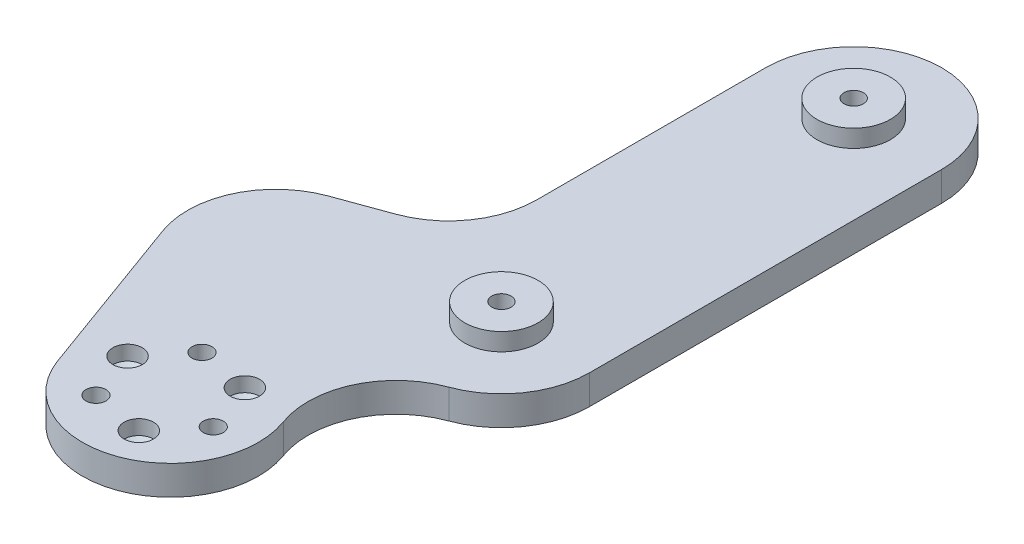
ISO-10303-21;
HEADER;
FILE_DESCRIPTION(('STEP AP214'),'2;1');
FILE_NAME('part.step','',(''),(''),'','','');
FILE_SCHEMA(('AUTOMOTIVE_DESIGN { 1 0 10303 214 1 1 1 1 }'));
ENDSEC;
DATA;
#1=APPLICATION_CONTEXT('core data for automotive mechanical design processes');
#2=APPLICATION_PROTOCOL_DEFINITION('international standard','automotive_design',2000,#1);
#3=PRODUCT_CONTEXT('',#1,'mechanical');
#4=PRODUCT('Part','Part','',(#3));
#5=PRODUCT_RELATED_PRODUCT_CATEGORY('part','',(#4));
#6=PRODUCT_DEFINITION_FORMATION('','',#4);
#7=PRODUCT_DEFINITION_CONTEXT('part definition',#1,'design');
#8=PRODUCT_DEFINITION('design','',#6,#7);
#9=PRODUCT_DEFINITION_SHAPE('','',#8);
#10=(LENGTH_UNIT() NAMED_UNIT(*) SI_UNIT(.MILLI.,.METRE.));
#11=(NAMED_UNIT(*) PLANE_ANGLE_UNIT() SI_UNIT($,.RADIAN.));
#12=(NAMED_UNIT(*) SI_UNIT($,.STERADIAN.) SOLID_ANGLE_UNIT());
#13=UNCERTAINTY_MEASURE_WITH_UNIT(LENGTH_MEASURE(1.E-05),#10,'distance_accuracy_value','');
#14=(GEOMETRIC_REPRESENTATION_CONTEXT(3) GLOBAL_UNCERTAINTY_ASSIGNED_CONTEXT((#13)) GLOBAL_UNIT_ASSIGNED_CONTEXT((#10,
#11,#12)) REPRESENTATION_CONTEXT('',''));
#15=CARTESIAN_POINT('',(0.,0.,0.));
#16=DIRECTION('',(0.,0.,1.));
#17=DIRECTION('',(1.,0.,0.));
#18=AXIS2_PLACEMENT_3D('',#15,#16,#17);
#19=CARTESIAN_POINT('',(-28.1907786235773,5.,10.26060429977));
#20=DIRECTION('',(0.,-1.,0.));
#21=DIRECTION('',(0.,0.,-1.));
#22=AXIS2_PLACEMENT_3D('',#19,#20,#21);
#23=CYLINDRICAL_SURFACE('',#22,15.);
#24=CARTESIAN_POINT('',(-28.1907786235773,0.,10.26060429977));
#25=DIRECTION('',(0.,-1.,0.));
#26=DIRECTION('',(0.,0.,-1.));
#27=AXIS2_PLACEMENT_3D('',#24,#25,#26);
#28=CIRCLE('',#27,15.);
#29=CARTESIAN_POINT('',(-42.2861679353659,0.,15.390906449655));
#30=VERTEX_POINT('',#29);
#31=CARTESIAN_POINT('',(-33.3210807734623,0.,-3.83478501201867));
#32=VERTEX_POINT('',#31);
#33=EDGE_CURVE('E193',#30,#32,#28,.T.);
#34=ORIENTED_EDGE('',*,*,#33,.F.);
#35=DIRECTION('',(0.,-1.,0.));
#36=VECTOR('',#35,1.);
#37=CARTESIAN_POINT('',(-42.2861679353659,5.,15.390906449655));
#38=LINE('',#37,#36);
#39=CARTESIAN_POINT('',(-42.2861679353659,5.,15.390906449655));
#40=VERTEX_POINT('',#39);
#41=EDGE_CURVE('E191',#40,#30,#38,.T.);
#42=ORIENTED_EDGE('',*,*,#41,.F.);
#43=CARTESIAN_POINT('',(-28.1907786235773,5.,10.26060429977));
#44=DIRECTION('',(0.,-1.,0.));
#45=DIRECTION('',(0.,0.,-1.));
#46=AXIS2_PLACEMENT_3D('',#43,#44,#45);
#47=CIRCLE('',#46,15.);
#48=CARTESIAN_POINT('',(-33.3210807734623,5.,-3.83478501201867));
#49=VERTEX_POINT('',#48);
#50=EDGE_CURVE('E198',#40,#49,#47,.T.);
#51=ORIENTED_EDGE('',*,*,#50,.T.);
#52=DIRECTION('',(0.,-1.,0.));
#53=VECTOR('',#52,1.);
#54=CARTESIAN_POINT('',(-33.3210807734623,5.,-3.83478501201867));
#55=LINE('',#54,#53);
#56=EDGE_CURVE('E206',#49,#32,#55,.T.);
#57=ORIENTED_EDGE('',*,*,#56,.T.);
#58=EDGE_LOOP('',(#34,#42,#51,#57));
#59=FACE_BOUND('',#58,.T.);
#60=ADVANCED_FACE('F35',(#59),#23,.T.);
#61=CARTESIAN_POINT('',(0.,8.,0.));
#62=DIRECTION('',(0.,1.,0.));
#63=DIRECTION('',(0.,0.,1.));
#64=AXIS2_PLACEMENT_3D('',#61,#62,#63);
#65=CYLINDRICAL_SURFACE('',#64,1.64999999999999);
#66=CARTESIAN_POINT('',(0.,8.,0.));
#67=DIRECTION('',(0.,1.,0.));
#68=DIRECTION('',(0.,0.,1.));
#69=AXIS2_PLACEMENT_3D('',#66,#67,#68);
#70=CIRCLE('',#69,1.64999999999999);
#71=CARTESIAN_POINT('',(0.,8.,1.64999999999999));
#72=VERTEX_POINT('',#71);
#73=EDGE_CURVE('E209',#72,#72,#70,.T.);
#74=ORIENTED_EDGE('',*,*,#73,.T.);
#75=EDGE_LOOP('',(#74));
#76=FACE_BOUND('',#75,.T.);
#77=CARTESIAN_POINT('',(0.,5.,0.));
#78=DIRECTION('',(0.,-1.,0.));
#79=DIRECTION('',(0.,0.,-1.));
#80=AXIS2_PLACEMENT_3D('',#77,#78,#79);
#81=CIRCLE('',#80,1.64999999999999);
#82=CARTESIAN_POINT('',(0.,5.,-1.64999999999999));
#83=VERTEX_POINT('',#82);
#84=EDGE_CURVE('E257',#83,#83,#81,.F.);
#85=ORIENTED_EDGE('',*,*,#84,.F.);
#86=EDGE_LOOP('',(#85));
#87=FACE_BOUND('',#86,.T.);
#88=ADVANCED_FACE('F332',(#76,#87),#65,.F.);
#89=CARTESIAN_POINT('',(0.,5.,0.));
#90=DIRECTION('',(0.,-1.,0.));
#91=DIRECTION('',(0.,0.,-1.));
#92=AXIS2_PLACEMENT_3D('',#89,#90,#91);
#93=CYLINDRICAL_SURFACE('',#92,15.);
#94=CARTESIAN_POINT('',(0.,5.,0.));
#95=DIRECTION('',(0.,1.,0.));
#96=DIRECTION('',(0.,0.,1.));
#97=AXIS2_PLACEMENT_3D('',#94,#95,#96);
#98=CIRCLE('',#97,15.);
#99=CARTESIAN_POINT('',(5.13030214988499,5.,14.0953893117886));
#100=VERTEX_POINT('',#99);
#101=CARTESIAN_POINT('',(15.,5.,0.));
#102=VERTEX_POINT('',#101);
#103=EDGE_CURVE('E232',#100,#102,#98,.T.);
#104=ORIENTED_EDGE('',*,*,#103,.F.);
#105=DIRECTION('',(0.,-1.,0.));
#106=VECTOR('',#105,1.);
#107=CARTESIAN_POINT('',(5.13030214988499,5.,14.0953893117886));
#108=LINE('',#107,#106);
#109=CARTESIAN_POINT('',(5.13030214988499,0.,14.0953893117886));
#110=VERTEX_POINT('',#109);
#111=EDGE_CURVE('E203',#100,#110,#108,.T.);
#112=ORIENTED_EDGE('',*,*,#111,.T.);
#113=CARTESIAN_POINT('',(0.,0.,0.));
#114=DIRECTION('',(0.,1.,0.));
#115=DIRECTION('',(0.,0.,1.));
#116=AXIS2_PLACEMENT_3D('',#113,#114,#115);
#117=CIRCLE('',#116,15.);
#118=CARTESIAN_POINT('',(15.,0.,0.));
#119=VERTEX_POINT('',#118);
#120=EDGE_CURVE('E229',#110,#119,#117,.T.);
#121=ORIENTED_EDGE('',*,*,#120,.T.);
#122=DIRECTION('',(0.,-1.,0.));
#123=VECTOR('',#122,1.);
#124=CARTESIAN_POINT('',(15.,5.,0.));
#125=LINE('',#124,#123);
#126=EDGE_CURVE('E254',#102,#119,#125,.T.);
#127=ORIENTED_EDGE('',*,*,#126,.F.);
#128=EDGE_LOOP('',(#104,#112,#121,#127));
#129=FACE_BOUND('',#128,.T.);
#130=ADVANCED_FACE('F294',(#129),#93,.T.);
#131=CARTESIAN_POINT('',(15.,5.,0.));
#132=DIRECTION('',(-1.,0.,0.));
#133=DIRECTION('',(0.,0.,1.));
#134=AXIS2_PLACEMENT_3D('',#131,#132,#133);
#135=PLANE('',#134);
#136=DIRECTION('',(0.,0.,-1.));
#137=VECTOR('',#136,1.);
#138=CARTESIAN_POINT('',(15.,0.,0.));
#139=LINE('',#138,#137);
#140=CARTESIAN_POINT('',(15.,0.,-60.));
#141=VERTEX_POINT('',#140);
#142=EDGE_CURVE('E243',#119,#141,#139,.T.);
#143=ORIENTED_EDGE('',*,*,#142,.T.);
#144=DIRECTION('',(0.,-1.,0.));
#145=VECTOR('',#144,1.);
#146=CARTESIAN_POINT('',(15.,5.,-60.));
#147=LINE('',#146,#145);
#148=CARTESIAN_POINT('',(15.,5.,-60.));
#149=VERTEX_POINT('',#148);
#150=EDGE_CURVE('E251',#149,#141,#147,.T.);
#151=ORIENTED_EDGE('',*,*,#150,.F.);
#152=DIRECTION('',(0.,0.,-1.));
#153=VECTOR('',#152,1.);
#154=CARTESIAN_POINT('',(15.,5.,0.));
#155=LINE('',#154,#153);
#156=EDGE_CURVE('E234',#102,#149,#155,.T.);
#157=ORIENTED_EDGE('',*,*,#156,.F.);
#158=ORIENTED_EDGE('',*,*,#126,.T.);
#159=EDGE_LOOP('',(#143,#151,#157,#158));
#160=FACE_BOUND('',#159,.T.);
#161=ADVANCED_FACE('F296',(#160),#135,.F.);
#162=CARTESIAN_POINT('',(0.,5.,-60.));
#163=DIRECTION('',(0.,-1.,0.));
#164=DIRECTION('',(0.,0.,-1.));
#165=AXIS2_PLACEMENT_3D('',#162,#163,#164);
#166=CYLINDRICAL_SURFACE('',#165,15.);
#167=CARTESIAN_POINT('',(0.,0.,-60.));
#168=DIRECTION('',(0.,1.,0.));
#169=DIRECTION('',(0.,0.,1.));
#170=AXIS2_PLACEMENT_3D('',#167,#168,#169);
#171=CIRCLE('',#170,15.);
#172=CARTESIAN_POINT('',(-15.,0.,-60.));
#173=VERTEX_POINT('',#172);
#174=EDGE_CURVE('E245',#141,#173,#171,.T.);
#175=ORIENTED_EDGE('',*,*,#174,.T.);
#176=DIRECTION('',(0.,-1.,0.));
#177=VECTOR('',#176,1.);
#178=CARTESIAN_POINT('',(-15.,5.,-60.));
#179=LINE('',#178,#177);
#180=CARTESIAN_POINT('',(-15.,5.,-60.));
#181=VERTEX_POINT('',#180);
#182=EDGE_CURVE('E241',#181,#173,#179,.T.);
#183=ORIENTED_EDGE('',*,*,#182,.F.);
#184=CARTESIAN_POINT('',(0.,5.,-60.));
#185=DIRECTION('',(0.,1.,0.));
#186=DIRECTION('',(0.,0.,1.));
#187=AXIS2_PLACEMENT_3D('',#184,#185,#186);
#188=CIRCLE('',#187,15.);
#189=EDGE_CURVE('E237',#149,#181,#188,.T.);
#190=ORIENTED_EDGE('',*,*,#189,.F.);
#191=ORIENTED_EDGE('',*,*,#150,.T.);
#192=EDGE_LOOP('',(#175,#183,#190,#191));
#193=FACE_BOUND('',#192,.T.);
#194=ADVANCED_FACE('F302',(#193),#166,.T.);
#195=CARTESIAN_POINT('',(-15.,5.,0.));
#196=DIRECTION('',(1.,0.,0.));
#197=DIRECTION('',(0.,0.,-1.));
#198=AXIS2_PLACEMENT_3D('',#195,#196,#197);
#199=PLANE('',#198);
#200=DIRECTION('',(0.,0.,1.));
#201=VECTOR('',#200,1.);
#202=CARTESIAN_POINT('',(-15.,0.,0.));
#203=LINE('',#202,#201);
#204=CARTESIAN_POINT('',(-15.,0.,-21.0062261462914));
#205=VERTEX_POINT('',#204);
#206=EDGE_CURVE('E235',#173,#205,#203,.T.);
#207=ORIENTED_EDGE('',*,*,#206,.T.);
#208=DIRECTION('',(0.,1.,0.));
#209=VECTOR('',#208,1.);
#210=CARTESIAN_POINT('',(-15.,5.,-21.0062261462914));
#211=LINE('',#210,#209);
#212=CARTESIAN_POINT('',(-15.,5.,-21.0062261462914));
#213=VERTEX_POINT('',#212);
#214=EDGE_CURVE('E260',#205,#213,#211,.T.);
#215=ORIENTED_EDGE('',*,*,#214,.T.);
#216=DIRECTION('',(0.,0.,1.));
#217=VECTOR('',#216,1.);
#218=CARTESIAN_POINT('',(-15.,5.,0.));
#219=LINE('',#218,#217);
#220=EDGE_CURVE('E239',#181,#213,#219,.T.);
#221=ORIENTED_EDGE('',*,*,#220,.F.);
#222=ORIENTED_EDGE('',*,*,#182,.T.);
#223=EDGE_LOOP('',(#207,#215,#221,#222));
#224=FACE_BOUND('',#223,.T.);
#225=ADVANCED_FACE('F306',(#224),#199,.F.);
#226=CARTESIAN_POINT('',(0.,5.,0.));
#227=DIRECTION('',(0.,1.,0.));
#228=DIRECTION('',(0.,0.,1.));
#229=AXIS2_PLACEMENT_3D('',#226,#227,#228);
#230=PLANE('',#229);
#231=CARTESIAN_POINT('',(-26.7934441009171,5.,36.8885493243449));
#232=DIRECTION('',(0.,1.,0.));
#233=DIRECTION('',(0.,0.,1.));
#234=AXIS2_PLACEMENT_3D('',#231,#232,#233);
#235=CIRCLE('',#234,2.49999999999999);
#236=CARTESIAN_POINT('',(-26.7934441009171,5.,39.3885493243449));
#237=VERTEX_POINT('',#236);
#238=EDGE_CURVE('E133',#237,#237,#235,.T.);
#239=ORIENTED_EDGE('',*,*,#238,.F.);
#240=EDGE_LOOP('',(#239));
#241=FACE_BOUND('',#240,.T.);
#242=CARTESIAN_POINT('',(-12.1450858366284,5.,31.5569829352764));
#243=DIRECTION('',(0.,1.,0.));
#244=DIRECTION('',(0.,0.,1.));
#245=AXIS2_PLACEMENT_3D('',#242,#243,#244);
#246=CIRCLE('',#245,2.49999999999999);
#247=CARTESIAN_POINT('',(-12.1450858366284,5.,34.0569829352764));
#248=VERTEX_POINT('',#247);
#249=EDGE_CURVE('E132',#248,#248,#246,.T.);
#250=ORIENTED_EDGE('',*,*,#249,.F.);
#251=EDGE_LOOP('',(#250));
#252=FACE_BOUND('',#251,.T.);
#253=CARTESIAN_POINT('',(-14.8519930338762,5.,46.9086165104204));
#254=DIRECTION('',(0.,1.,0.));
#255=DIRECTION('',(0.,0.,1.));
#256=AXIS2_PLACEMENT_3D('',#253,#254,#255);
#257=CIRCLE('',#256,2.49999999999999);
#258=CARTESIAN_POINT('',(-14.8519930338762,5.,49.4086165104204));
#259=VERTEX_POINT('',#258);
#260=EDGE_CURVE('E143',#259,#259,#257,.T.);
#261=ORIENTED_EDGE('',*,*,#260,.F.);
#262=EDGE_LOOP('',(#261));
#263=FACE_BOUND('',#262,.T.);
#264=CARTESIAN_POINT('',(-23.7152628109861,5.,45.345782911418));
#265=DIRECTION('',(0.,1.,0.));
#266=DIRECTION('',(0.,0.,1.));
#267=AXIS2_PLACEMENT_3D('',#264,#265,#266);
#268=CIRCLE('',#267,1.7);
#269=CARTESIAN_POINT('',(-23.7152628109861,5.,47.045782911418));
#270=VERTEX_POINT('',#269);
#271=EDGE_CURVE('E158',#270,#270,#268,.T.);
#272=ORIENTED_EDGE('',*,*,#271,.F.);
#273=EDGE_LOOP('',(#272));
#274=FACE_BOUND('',#273,.T.);
#275=CARTESIAN_POINT('',(-9.06690454669735,5.,40.0142165223496));
#276=DIRECTION('',(0.,1.,0.));
#277=DIRECTION('',(0.,0.,1.));
#278=AXIS2_PLACEMENT_3D('',#275,#276,#277);
#279=CIRCLE('',#278,1.7);
#280=CARTESIAN_POINT('',(-9.06690454669735,5.,41.7142165223496));
#281=VERTEX_POINT('',#280);
#282=EDGE_CURVE('E168',#281,#281,#279,.T.);
#283=ORIENTED_EDGE('',*,*,#282,.F.);
#284=EDGE_LOOP('',(#283));
#285=FACE_BOUND('',#284,.T.);
#286=CARTESIAN_POINT('',(-21.0083556137382,5.,29.994149336274));
#287=DIRECTION('',(0.,1.,0.));
#288=DIRECTION('',(0.,0.,1.));
#289=AXIS2_PLACEMENT_3D('',#286,#287,#288);
#290=CIRCLE('',#289,1.7);
#291=CARTESIAN_POINT('',(-21.0083556137382,5.,31.694149336274));
#292=VERTEX_POINT('',#291);
#293=EDGE_CURVE('E178',#292,#292,#290,.T.);
#294=ORIENTED_EDGE('',*,*,#293,.F.);
#295=EDGE_LOOP('',(#294));
#296=FACE_BOUND('',#295,.T.);
#297=DIRECTION('',(0.93969262078591,0.,-0.342020143325666));
#298=VECTOR('',#297,1.);
#299=CARTESIAN_POINT('',(-5.13030214988499,5.,-14.0953893117886));
#300=LINE('',#299,#298);
#301=CARTESIAN_POINT('',(-24.869697850115,5.,-6.91083683450272));
#302=VERTEX_POINT('',#301);
#303=EDGE_CURVE('E200',#49,#302,#300,.T.);
#304=ORIENTED_EDGE('',*,*,#303,.F.);
#305=ORIENTED_EDGE('',*,*,#50,.F.);
#306=DIRECTION('',(-0.342020143325669,0.,-0.939692620785908));
#307=VECTOR('',#306,1.);
#308=CARTESIAN_POINT('',(-42.2861679353659,5.,15.390906449655));
#309=LINE('',#308,#307);
#310=CARTESIAN_POINT('',(-32.0255636355958,5.,43.5816850732323));
#311=VERTEX_POINT('',#310);
#312=EDGE_CURVE('E182',#311,#40,#309,.T.);
#313=ORIENTED_EDGE('',*,*,#312,.F.);
#314=CARTESIAN_POINT('',(-17.9301743238072,5.,38.4513829233472));
#315=DIRECTION('',(0.,-1.,0.));
#316=DIRECTION('',(0.,0.,-1.));
#317=AXIS2_PLACEMENT_3D('',#314,#315,#316);
#318=CIRCLE('',#317,15.);
#319=CARTESIAN_POINT('',(-3.8347850120186,5.,33.3210807734622));
#320=VERTEX_POINT('',#319);
#321=EDGE_CURVE('E179',#320,#311,#318,.T.);
#322=ORIENTED_EDGE('',*,*,#321,.F.);
#323=CARTESIAN_POINT('',(10.2606042997701,5.,28.1907786235773));
#324=DIRECTION('',(0.,1.,0.));
#325=DIRECTION('',(0.,0.,1.));
#326=AXIS2_PLACEMENT_3D('',#323,#324,#325);
#327=CIRCLE('',#326,15.);
#328=EDGE_CURVE('E270',#320,#100,#327,.F.);
#329=ORIENTED_EDGE('',*,*,#328,.T.);
#330=ORIENTED_EDGE('',*,*,#103,.T.);
#331=ORIENTED_EDGE('',*,*,#156,.T.);
#332=ORIENTED_EDGE('',*,*,#189,.T.);
#333=ORIENTED_EDGE('',*,*,#220,.T.);
#334=CARTESIAN_POINT('',(-30.,5.,-21.0062261462914));
#335=DIRECTION('',(0.,1.,0.));
#336=DIRECTION('',(0.,0.,1.));
#337=AXIS2_PLACEMENT_3D('',#334,#335,#336);
#338=CIRCLE('',#337,15.);
#339=EDGE_CURVE('E43',#213,#302,#338,.F.);
#340=ORIENTED_EDGE('',*,*,#339,.T.);
#341=EDGE_LOOP('',(#304,#305,#313,#322,#329,#330,#331,#332,#333,#340));
#342=FACE_BOUND('',#341,.T.);
#343=CARTESIAN_POINT('',(0.,5.,-60.));
#344=DIRECTION('',(0.,1.,0.));
#345=DIRECTION('',(0.,0.,1.));
#346=AXIS2_PLACEMENT_3D('',#343,#344,#345);
#347=CIRCLE('',#346,6.25000000000001);
#348=CARTESIAN_POINT('',(0.,5.,-53.75));
#349=VERTEX_POINT('',#348);
#350=EDGE_CURVE('E223',#349,#349,#347,.T.);
#351=ORIENTED_EDGE('',*,*,#350,.F.);
#352=EDGE_LOOP('',(#351));
#353=FACE_BOUND('',#352,.T.);
#354=CARTESIAN_POINT('',(0.,5.,0.));
#355=DIRECTION('',(0.,1.,0.));
#356=DIRECTION('',(0.,0.,1.));
#357=AXIS2_PLACEMENT_3D('',#354,#355,#356);
#358=CIRCLE('',#357,6.25000000000001);
#359=CARTESIAN_POINT('',(0.,5.,6.25000000000001));
#360=VERTEX_POINT('',#359);
#361=EDGE_CURVE('E219',#360,#360,#358,.T.);
#362=ORIENTED_EDGE('',*,*,#361,.F.);
#363=EDGE_LOOP('',(#362));
#364=FACE_BOUND('',#363,.T.);
#365=ADVANCED_FACE('F288',(#241,#252,#263,#274,#285,#296,#342,#353,#364),#230,.T.);
#366=CARTESIAN_POINT('',(0.,0.,0.));
#367=DIRECTION('',(0.,1.,0.));
#368=DIRECTION('',(0.,0.,1.));
#369=AXIS2_PLACEMENT_3D('',#366,#367,#368);
#370=PLANE('',#369);
#371=CARTESIAN_POINT('',(-23.7152628109861,0.,45.345782911418));
#372=DIRECTION('',(0.,-1.,0.));
#373=DIRECTION('',(0.,0.,-1.));
#374=AXIS2_PLACEMENT_3D('',#371,#372,#373);
#375=CIRCLE('',#374,3.25);
#376=CARTESIAN_POINT('',(-23.7152628109861,0.,42.095782911418));
#377=VERTEX_POINT('',#376);
#378=EDGE_CURVE('E149',#377,#377,#375,.T.);
#379=ORIENTED_EDGE('',*,*,#378,.F.);
#380=EDGE_LOOP('',(#379));
#381=FACE_BOUND('',#380,.T.);
#382=CARTESIAN_POINT('',(-9.06690454669735,0.,40.0142165223496));
#383=DIRECTION('',(0.,-1.,0.));
#384=DIRECTION('',(0.,0.,-1.));
#385=AXIS2_PLACEMENT_3D('',#382,#383,#384);
#386=CIRCLE('',#385,3.25);
#387=CARTESIAN_POINT('',(-9.06690454669735,0.,36.7642165223496));
#388=VERTEX_POINT('',#387);
#389=EDGE_CURVE('E159',#388,#388,#386,.T.);
#390=ORIENTED_EDGE('',*,*,#389,.F.);
#391=EDGE_LOOP('',(#390));
#392=FACE_BOUND('',#391,.T.);
#393=CARTESIAN_POINT('',(-21.0083556137382,0.,29.994149336274));
#394=DIRECTION('',(0.,-1.,0.));
#395=DIRECTION('',(0.,0.,-1.));
#396=AXIS2_PLACEMENT_3D('',#393,#394,#395);
#397=CIRCLE('',#396,3.25);
#398=CARTESIAN_POINT('',(-21.0083556137382,0.,26.744149336274));
#399=VERTEX_POINT('',#398);
#400=EDGE_CURVE('E169',#399,#399,#397,.T.);
#401=ORIENTED_EDGE('',*,*,#400,.F.);
#402=EDGE_LOOP('',(#401));
#403=FACE_BOUND('',#402,.T.);
#404=ORIENTED_EDGE('',*,*,#33,.T.);
#405=DIRECTION('',(0.93969262078591,0.,-0.342020143325666));
#406=VECTOR('',#405,1.);
#407=CARTESIAN_POINT('',(-5.13030214988499,0.,-14.0953893117886));
#408=LINE('',#407,#406);
#409=CARTESIAN_POINT('',(-24.869697850115,0.,-6.91083683450272));
#410=VERTEX_POINT('',#409);
#411=EDGE_CURVE('E201',#32,#410,#408,.T.);
#412=ORIENTED_EDGE('',*,*,#411,.T.);
#413=CARTESIAN_POINT('',(-30.,0.,-21.0062261462914));
#414=DIRECTION('',(0.,1.,0.));
#415=DIRECTION('',(0.,0.,1.));
#416=AXIS2_PLACEMENT_3D('',#413,#414,#415);
#417=CIRCLE('',#416,15.);
#418=EDGE_CURVE('E11',#410,#205,#417,.T.);
#419=ORIENTED_EDGE('',*,*,#418,.T.);
#420=ORIENTED_EDGE('',*,*,#206,.F.);
#421=ORIENTED_EDGE('',*,*,#174,.F.);
#422=ORIENTED_EDGE('',*,*,#142,.F.);
#423=ORIENTED_EDGE('',*,*,#120,.F.);
#424=CARTESIAN_POINT('',(10.2606042997701,0.,28.1907786235773));
#425=DIRECTION('',(0.,1.,0.));
#426=DIRECTION('',(0.,0.,1.));
#427=AXIS2_PLACEMENT_3D('',#424,#425,#426);
#428=CIRCLE('',#427,15.);
#429=CARTESIAN_POINT('',(-3.8347850120186,0.,33.3210807734622));
#430=VERTEX_POINT('',#429);
#431=EDGE_CURVE('E272',#110,#430,#428,.T.);
#432=ORIENTED_EDGE('',*,*,#431,.T.);
#433=CARTESIAN_POINT('',(-17.9301743238072,0.,38.4513829233472));
#434=DIRECTION('',(0.,-1.,0.));
#435=DIRECTION('',(0.,0.,-1.));
#436=AXIS2_PLACEMENT_3D('',#433,#434,#435);
#437=CIRCLE('',#436,15.);
#438=CARTESIAN_POINT('',(-32.0255636355958,0.,43.5816850732323));
#439=VERTEX_POINT('',#438);
#440=EDGE_CURVE('E186',#430,#439,#437,.T.);
#441=ORIENTED_EDGE('',*,*,#440,.T.);
#442=DIRECTION('',(-0.342020143325669,0.,-0.939692620785908));
#443=VECTOR('',#442,1.);
#444=CARTESIAN_POINT('',(-42.2861679353659,0.,15.390906449655));
#445=LINE('',#444,#443);
#446=EDGE_CURVE('E183',#439,#30,#445,.T.);
#447=ORIENTED_EDGE('',*,*,#446,.T.);
#448=EDGE_LOOP('',(#404,#412,#419,#420,#421,#422,#423,#432,#441,#447));
#449=FACE_BOUND('',#448,.T.);
#450=ADVANCED_FACE('F277',(#381,#392,#403,#449),#370,.F.);
#451=CARTESIAN_POINT('',(0.,8.,-60.));
#452=DIRECTION('',(0.,-1.,0.));
#453=DIRECTION('',(0.,0.,-1.));
#454=AXIS2_PLACEMENT_3D('',#451,#452,#453);
#455=CYLINDRICAL_SURFACE('',#454,6.25000000000001);
#456=CARTESIAN_POINT('',(0.,8.,-60.));
#457=DIRECTION('',(0.,1.,0.));
#458=DIRECTION('',(0.,0.,1.));
#459=AXIS2_PLACEMENT_3D('',#456,#457,#458);
#460=CIRCLE('',#459,6.25000000000001);
#461=CARTESIAN_POINT('',(0.,8.,-53.75));
#462=VERTEX_POINT('',#461);
#463=EDGE_CURVE('E226',#462,#462,#460,.T.);
#464=ORIENTED_EDGE('',*,*,#463,.F.);
#465=EDGE_LOOP('',(#464));
#466=FACE_BOUND('',#465,.T.);
#467=ORIENTED_EDGE('',*,*,#350,.T.);
#468=EDGE_LOOP('',(#467));
#469=FACE_BOUND('',#468,.T.);
#470=ADVANCED_FACE('F360',(#466,#469),#455,.T.);
#471=CARTESIAN_POINT('',(0.,8.,-60.));
#472=DIRECTION('',(0.,1.,0.));
#473=DIRECTION('',(0.,0.,1.));
#474=AXIS2_PLACEMENT_3D('',#471,#472,#473);
#475=PLANE('',#474);
#476=CARTESIAN_POINT('',(0.,8.,-60.));
#477=DIRECTION('',(0.,1.,0.));
#478=DIRECTION('',(0.,0.,1.));
#479=AXIS2_PLACEMENT_3D('',#476,#477,#478);
#480=CIRCLE('',#479,1.64999999999999);
#481=CARTESIAN_POINT('',(0.,8.,-58.35));
#482=VERTEX_POINT('',#481);
#483=EDGE_CURVE('E213',#482,#482,#480,.T.);
#484=ORIENTED_EDGE('',*,*,#483,.F.);
#485=EDGE_LOOP('',(#484));
#486=FACE_BOUND('',#485,.T.);
#487=ORIENTED_EDGE('',*,*,#463,.T.);
#488=EDGE_LOOP('',(#487));
#489=FACE_BOUND('',#488,.T.);
#490=ADVANCED_FACE('F356',(#486,#489),#475,.T.);
#491=CARTESIAN_POINT('',(0.,8.,0.));
#492=DIRECTION('',(0.,-1.,0.));
#493=DIRECTION('',(0.,0.,-1.));
#494=AXIS2_PLACEMENT_3D('',#491,#492,#493);
#495=CYLINDRICAL_SURFACE('',#494,6.25000000000001);
#496=CARTESIAN_POINT('',(0.,8.,0.));
#497=DIRECTION('',(0.,1.,0.));
#498=DIRECTION('',(0.,0.,1.));
#499=AXIS2_PLACEMENT_3D('',#496,#497,#498);
#500=CIRCLE('',#499,6.25000000000001);
#501=CARTESIAN_POINT('',(0.,8.,6.25000000000001));
#502=VERTEX_POINT('',#501);
#503=EDGE_CURVE('E220',#502,#502,#500,.T.);
#504=ORIENTED_EDGE('',*,*,#503,.F.);
#505=EDGE_LOOP('',(#504));
#506=FACE_BOUND('',#505,.T.);
#507=ORIENTED_EDGE('',*,*,#361,.T.);
#508=EDGE_LOOP('',(#507));
#509=FACE_BOUND('',#508,.T.);
#510=ADVANCED_FACE('F352',(#506,#509),#495,.T.);
#511=CARTESIAN_POINT('',(0.,8.,0.));
#512=DIRECTION('',(0.,1.,0.));
#513=DIRECTION('',(0.,0.,1.));
#514=AXIS2_PLACEMENT_3D('',#511,#512,#513);
#515=PLANE('',#514);
#516=ORIENTED_EDGE('',*,*,#73,.F.);
#517=EDGE_LOOP('',(#516));
#518=FACE_BOUND('',#517,.T.);
#519=ORIENTED_EDGE('',*,*,#503,.T.);
#520=EDGE_LOOP('',(#519));
#521=FACE_BOUND('',#520,.T.);
#522=ADVANCED_FACE('F348',(#518,#521),#515,.T.);
#523=CARTESIAN_POINT('',(0.,3.,-60.));
#524=DIRECTION('',(0.,1.,0.));
#525=DIRECTION('',(0.,0.,1.));
#526=AXIS2_PLACEMENT_3D('',#523,#524,#525);
#527=CONICAL_SURFACE('',#526,1.65,1.02974425867665);
#528=CARTESIAN_POINT('',(0.,2.00857997860452,-60.));
#529=VERTEX_POINT('',#528);
#530=VERTEX_LOOP('',#529);
#531=FACE_BOUND('',#530,.T.);
#532=CARTESIAN_POINT('',(0.,3.,-60.));
#533=DIRECTION('',(0.,1.,0.));
#534=DIRECTION('',(0.,0.,1.));
#535=AXIS2_PLACEMENT_3D('',#532,#533,#534);
#536=CIRCLE('',#535,1.65);
#537=CARTESIAN_POINT('',(0.,3.,-58.35));
#538=VERTEX_POINT('',#537);
#539=EDGE_CURVE('E216',#538,#538,#536,.T.);
#540=ORIENTED_EDGE('',*,*,#539,.T.);
#541=EDGE_LOOP('',(#540));
#542=FACE_BOUND('',#541,.T.);
#543=ADVANCED_FACE('F344',(#531,#542),#527,.F.);
#544=CARTESIAN_POINT('',(0.,8.,-60.));
#545=DIRECTION('',(0.,1.,0.));
#546=DIRECTION('',(0.,0.,1.));
#547=AXIS2_PLACEMENT_3D('',#544,#545,#546);
#548=CYLINDRICAL_SURFACE('',#547,1.64999999999999);
#549=ORIENTED_EDGE('',*,*,#539,.F.);
#550=EDGE_LOOP('',(#549));
#551=FACE_BOUND('',#550,.T.);
#552=ORIENTED_EDGE('',*,*,#483,.T.);
#553=EDGE_LOOP('',(#552));
#554=FACE_BOUND('',#553,.T.);
#555=ADVANCED_FACE('F341',(#551,#554),#548,.F.);
#556=CARTESIAN_POINT('',(0.,5.,0.));
#557=DIRECTION('',(0.,-1.,0.));
#558=DIRECTION('',(0.,0.,-1.));
#559=AXIS2_PLACEMENT_3D('',#556,#557,#558);
#560=PLANE('',#559);
#561=ORIENTED_EDGE('',*,*,#84,.T.);
#562=EDGE_LOOP('',(#561));
#563=FACE_BOUND('',#562,.T.);
#564=ADVANCED_FACE('F328',(#563),#560,.F.);
#565=CARTESIAN_POINT('',(-5.13030214988499,5.,-14.0953893117886));
#566=DIRECTION('',(-0.342020143325666,0.,-0.939692620785909));
#567=DIRECTION('',(-0.93969262078591,0.,0.342020143325666));
#568=AXIS2_PLACEMENT_3D('',#565,#566,#567);
#569=PLANE('',#568);
#570=ORIENTED_EDGE('',*,*,#303,.T.);
#571=DIRECTION('',(0.,1.,0.));
#572=VECTOR('',#571,1.);
#573=CARTESIAN_POINT('',(-24.869697850115,5.,-6.91083683450272));
#574=LINE('',#573,#572);
#575=EDGE_CURVE('E56',#302,#410,#574,.F.);
#576=ORIENTED_EDGE('',*,*,#575,.T.);
#577=ORIENTED_EDGE('',*,*,#411,.F.);
#578=ORIENTED_EDGE('',*,*,#56,.F.);
#579=EDGE_LOOP('',(#570,#576,#577,#578));
#580=FACE_BOUND('',#579,.T.);
#581=ADVANCED_FACE('F312',(#580),#569,.T.);
#582=CARTESIAN_POINT('',(-42.2861679353659,5.,15.390906449655));
#583=DIRECTION('',(-0.939692620785908,0.,0.342020143325669));
#584=DIRECTION('',(0.342020143325669,0.,0.939692620785908));
#585=AXIS2_PLACEMENT_3D('',#582,#583,#584);
#586=PLANE('',#585);
#587=ORIENTED_EDGE('',*,*,#446,.F.);
#588=DIRECTION('',(0.,-1.,0.));
#589=VECTOR('',#588,1.);
#590=CARTESIAN_POINT('',(-32.0255636355958,5.,43.5816850732323));
#591=LINE('',#590,#589);
#592=EDGE_CURVE('E194',#311,#439,#591,.T.);
#593=ORIENTED_EDGE('',*,*,#592,.F.);
#594=ORIENTED_EDGE('',*,*,#312,.T.);
#595=ORIENTED_EDGE('',*,*,#41,.T.);
#596=EDGE_LOOP('',(#587,#593,#594,#595));
#597=FACE_BOUND('',#596,.T.);
#598=ADVANCED_FACE('F317',(#597),#586,.T.);
#599=CARTESIAN_POINT('',(-17.9301743238072,5.,38.4513829233472));
#600=DIRECTION('',(0.,-1.,0.));
#601=DIRECTION('',(0.,0.,-1.));
#602=AXIS2_PLACEMENT_3D('',#599,#600,#601);
#603=CYLINDRICAL_SURFACE('',#602,15.);
#604=ORIENTED_EDGE('',*,*,#440,.F.);
#605=DIRECTION('',(0.,-1.,0.));
#606=VECTOR('',#605,1.);
#607=CARTESIAN_POINT('',(-3.8347850120186,5.,33.3210807734622));
#608=LINE('',#607,#606);
#609=EDGE_CURVE('E185',#320,#430,#608,.T.);
#610=ORIENTED_EDGE('',*,*,#609,.F.);
#611=ORIENTED_EDGE('',*,*,#321,.T.);
#612=ORIENTED_EDGE('',*,*,#592,.T.);
#613=EDGE_LOOP('',(#604,#610,#611,#612));
#614=FACE_BOUND('',#613,.T.);
#615=ADVANCED_FACE('F284',(#614),#603,.T.);
#616=CARTESIAN_POINT('',(-21.0083556137382,0.,29.994149336274));
#617=DIRECTION('',(0.,-1.,0.));
#618=DIRECTION('',(0.,0.,-1.));
#619=AXIS2_PLACEMENT_3D('',#616,#617,#618);
#620=CYLINDRICAL_SURFACE('',#619,1.7);
#621=ORIENTED_EDGE('',*,*,#293,.T.);
#622=EDGE_LOOP('',(#621));
#623=FACE_BOUND('',#622,.T.);
#624=CARTESIAN_POINT('',(-21.0083556137382,2.,29.994149336274));
#625=DIRECTION('',(0.,-1.,0.));
#626=DIRECTION('',(0.,0.,-1.));
#627=AXIS2_PLACEMENT_3D('',#624,#625,#626);
#628=CIRCLE('',#627,1.7);
#629=CARTESIAN_POINT('',(-21.0083556137382,2.,28.294149336274));
#630=VERTEX_POINT('',#629);
#631=EDGE_CURVE('E175',#630,#630,#628,.T.);
#632=ORIENTED_EDGE('',*,*,#631,.T.);
#633=EDGE_LOOP('',(#632));
#634=FACE_BOUND('',#633,.T.);
#635=ADVANCED_FACE('F325',(#623,#634),#620,.F.);
#636=CARTESIAN_POINT('',(-19.3083556137382,2.,29.994149336274));
#637=DIRECTION('',(0.,1.,0.));
#638=DIRECTION('',(0.,0.,1.));
#639=AXIS2_PLACEMENT_3D('',#636,#637,#638);
#640=PLANE('',#639);
#641=ORIENTED_EDGE('',*,*,#631,.F.);
#642=EDGE_LOOP('',(#641));
#643=FACE_BOUND('',#642,.T.);
#644=CARTESIAN_POINT('',(-21.0083556137382,2.,29.994149336274));
#645=DIRECTION('',(0.,-1.,0.));
#646=DIRECTION('',(0.,0.,-1.));
#647=AXIS2_PLACEMENT_3D('',#644,#645,#646);
#648=CIRCLE('',#647,3.25);
#649=CARTESIAN_POINT('',(-21.0083556137382,2.,26.744149336274));
#650=VERTEX_POINT('',#649);
#651=EDGE_CURVE('E172',#650,#650,#648,.T.);
#652=ORIENTED_EDGE('',*,*,#651,.T.);
#653=EDGE_LOOP('',(#652));
#654=FACE_BOUND('',#653,.T.);
#655=ADVANCED_FACE('F430',(#643,#654),#640,.F.);
#656=CARTESIAN_POINT('',(-21.0083556137382,0.,29.994149336274));
#657=DIRECTION('',(0.,-1.,0.));
#658=DIRECTION('',(0.,0.,-1.));
#659=AXIS2_PLACEMENT_3D('',#656,#657,#658);
#660=CYLINDRICAL_SURFACE('',#659,3.25);
#661=ORIENTED_EDGE('',*,*,#651,.F.);
#662=EDGE_LOOP('',(#661));
#663=FACE_BOUND('',#662,.T.);
#664=ORIENTED_EDGE('',*,*,#400,.T.);
#665=EDGE_LOOP('',(#664));
#666=FACE_BOUND('',#665,.T.);
#667=ADVANCED_FACE('F426',(#663,#666),#660,.F.);
#668=CARTESIAN_POINT('',(-9.06690454669735,0.,40.0142165223496));
#669=DIRECTION('',(0.,-1.,0.));
#670=DIRECTION('',(0.,0.,-1.));
#671=AXIS2_PLACEMENT_3D('',#668,#669,#670);
#672=CYLINDRICAL_SURFACE('',#671,1.7);
#673=ORIENTED_EDGE('',*,*,#282,.T.);
#674=EDGE_LOOP('',(#673));
#675=FACE_BOUND('',#674,.T.);
#676=CARTESIAN_POINT('',(-9.06690454669735,2.,40.0142165223496));
#677=DIRECTION('',(0.,-1.,0.));
#678=DIRECTION('',(0.,0.,-1.));
#679=AXIS2_PLACEMENT_3D('',#676,#677,#678);
#680=CIRCLE('',#679,1.7);
#681=CARTESIAN_POINT('',(-9.06690454669735,2.,38.3142165223496));
#682=VERTEX_POINT('',#681);
#683=EDGE_CURVE('E165',#682,#682,#680,.T.);
#684=ORIENTED_EDGE('',*,*,#683,.T.);
#685=EDGE_LOOP('',(#684));
#686=FACE_BOUND('',#685,.T.);
#687=ADVANCED_FACE('F422',(#675,#686),#672,.F.);
#688=CARTESIAN_POINT('',(-7.36690454669735,2.,40.0142165223496));
#689=DIRECTION('',(0.,1.,0.));
#690=DIRECTION('',(0.,0.,1.));
#691=AXIS2_PLACEMENT_3D('',#688,#689,#690);
#692=PLANE('',#691);
#693=ORIENTED_EDGE('',*,*,#683,.F.);
#694=EDGE_LOOP('',(#693));
#695=FACE_BOUND('',#694,.T.);
#696=CARTESIAN_POINT('',(-9.06690454669735,2.,40.0142165223496));
#697=DIRECTION('',(0.,-1.,0.));
#698=DIRECTION('',(0.,0.,-1.));
#699=AXIS2_PLACEMENT_3D('',#696,#697,#698);
#700=CIRCLE('',#699,3.25);
#701=CARTESIAN_POINT('',(-9.06690454669735,2.,36.7642165223496));
#702=VERTEX_POINT('',#701);
#703=EDGE_CURVE('E162',#702,#702,#700,.T.);
#704=ORIENTED_EDGE('',*,*,#703,.T.);
#705=EDGE_LOOP('',(#704));
#706=FACE_BOUND('',#705,.T.);
#707=ADVANCED_FACE('F418',(#695,#706),#692,.F.);
#708=CARTESIAN_POINT('',(-9.06690454669735,0.,40.0142165223496));
#709=DIRECTION('',(0.,-1.,0.));
#710=DIRECTION('',(0.,0.,-1.));
#711=AXIS2_PLACEMENT_3D('',#708,#709,#710);
#712=CYLINDRICAL_SURFACE('',#711,3.25);
#713=ORIENTED_EDGE('',*,*,#703,.F.);
#714=EDGE_LOOP('',(#713));
#715=FACE_BOUND('',#714,.T.);
#716=ORIENTED_EDGE('',*,*,#389,.T.);
#717=EDGE_LOOP('',(#716));
#718=FACE_BOUND('',#717,.T.);
#719=ADVANCED_FACE('F414',(#715,#718),#712,.F.);
#720=CARTESIAN_POINT('',(-23.7152628109861,0.,45.345782911418));
#721=DIRECTION('',(0.,-1.,0.));
#722=DIRECTION('',(0.,0.,-1.));
#723=AXIS2_PLACEMENT_3D('',#720,#721,#722);
#724=CYLINDRICAL_SURFACE('',#723,1.7);
#725=ORIENTED_EDGE('',*,*,#271,.T.);
#726=EDGE_LOOP('',(#725));
#727=FACE_BOUND('',#726,.T.);
#728=CARTESIAN_POINT('',(-23.7152628109861,2.,45.345782911418));
#729=DIRECTION('',(0.,-1.,0.));
#730=DIRECTION('',(0.,0.,-1.));
#731=AXIS2_PLACEMENT_3D('',#728,#729,#730);
#732=CIRCLE('',#731,1.7);
#733=CARTESIAN_POINT('',(-23.7152628109861,2.,43.645782911418));
#734=VERTEX_POINT('',#733);
#735=EDGE_CURVE('E155',#734,#734,#732,.T.);
#736=ORIENTED_EDGE('',*,*,#735,.T.);
#737=EDGE_LOOP('',(#736));
#738=FACE_BOUND('',#737,.T.);
#739=ADVANCED_FACE('F410',(#727,#738),#724,.F.);
#740=CARTESIAN_POINT('',(-22.0152628109861,2.,45.345782911418));
#741=DIRECTION('',(0.,1.,0.));
#742=DIRECTION('',(0.,0.,1.));
#743=AXIS2_PLACEMENT_3D('',#740,#741,#742);
#744=PLANE('',#743);
#745=ORIENTED_EDGE('',*,*,#735,.F.);
#746=EDGE_LOOP('',(#745));
#747=FACE_BOUND('',#746,.T.);
#748=CARTESIAN_POINT('',(-23.7152628109861,2.,45.345782911418));
#749=DIRECTION('',(0.,-1.,0.));
#750=DIRECTION('',(0.,0.,-1.));
#751=AXIS2_PLACEMENT_3D('',#748,#749,#750);
#752=CIRCLE('',#751,3.25);
#753=CARTESIAN_POINT('',(-23.7152628109861,2.,42.095782911418));
#754=VERTEX_POINT('',#753);
#755=EDGE_CURVE('E152',#754,#754,#752,.T.);
#756=ORIENTED_EDGE('',*,*,#755,.T.);
#757=EDGE_LOOP('',(#756));
#758=FACE_BOUND('',#757,.T.);
#759=ADVANCED_FACE('F406',(#747,#758),#744,.F.);
#760=CARTESIAN_POINT('',(-23.7152628109861,0.,45.345782911418));
#761=DIRECTION('',(0.,-1.,0.));
#762=DIRECTION('',(0.,0.,-1.));
#763=AXIS2_PLACEMENT_3D('',#760,#761,#762);
#764=CYLINDRICAL_SURFACE('',#763,3.25);
#765=ORIENTED_EDGE('',*,*,#755,.F.);
#766=EDGE_LOOP('',(#765));
#767=FACE_BOUND('',#766,.T.);
#768=ORIENTED_EDGE('',*,*,#378,.T.);
#769=EDGE_LOOP('',(#768));
#770=FACE_BOUND('',#769,.T.);
#771=ADVANCED_FACE('F402',(#767,#770),#764,.F.);
#772=CARTESIAN_POINT('',(-14.8519930338762,2.5,46.9086165104204));
#773=DIRECTION('',(0.,1.,0.));
#774=DIRECTION('',(0.,0.,1.));
#775=AXIS2_PLACEMENT_3D('',#772,#773,#774);
#776=CONICAL_SURFACE('',#775,2.5,1.02974425867665);
#777=CARTESIAN_POINT('',(-14.8519930338762,0.9978484524311,46.9086165104204));
#778=VERTEX_POINT('',#777);
#779=VERTEX_LOOP('',#778);
#780=FACE_BOUND('',#779,.T.);
#781=CARTESIAN_POINT('',(-14.8519930338762,2.5,46.9086165104204));
#782=DIRECTION('',(0.,1.,0.));
#783=DIRECTION('',(0.,0.,1.));
#784=AXIS2_PLACEMENT_3D('',#781,#782,#783);
#785=CIRCLE('',#784,2.5);
#786=CARTESIAN_POINT('',(-14.8519930338762,2.5,49.4086165104204));
#787=VERTEX_POINT('',#786);
#788=EDGE_CURVE('E146',#787,#787,#785,.T.);
#789=ORIENTED_EDGE('',*,*,#788,.T.);
#790=EDGE_LOOP('',(#789));
#791=FACE_BOUND('',#790,.T.);
#792=ADVANCED_FACE('F398',(#780,#791),#776,.F.);
#793=CARTESIAN_POINT('',(-14.8519930338762,5.,46.9086165104204));
#794=DIRECTION('',(0.,1.,0.));
#795=DIRECTION('',(0.,0.,1.));
#796=AXIS2_PLACEMENT_3D('',#793,#794,#795);
#797=CYLINDRICAL_SURFACE('',#796,2.5);
#798=ORIENTED_EDGE('',*,*,#788,.F.);
#799=EDGE_LOOP('',(#798));
#800=FACE_BOUND('',#799,.T.);
#801=ORIENTED_EDGE('',*,*,#260,.T.);
#802=EDGE_LOOP('',(#801));
#803=FACE_BOUND('',#802,.T.);
#804=ADVANCED_FACE('F394',(#800,#803),#797,.F.);
#805=CARTESIAN_POINT('',(-12.1450858366284,2.5,31.5569829352764));
#806=DIRECTION('',(0.,1.,0.));
#807=DIRECTION('',(0.,0.,1.));
#808=AXIS2_PLACEMENT_3D('',#805,#806,#807);
#809=CONICAL_SURFACE('',#808,2.5,1.02974425867665);
#810=CARTESIAN_POINT('',(-12.1450858366284,0.9978484524311,31.5569829352764));
#811=VERTEX_POINT('',#810);
#812=VERTEX_LOOP('',#811);
#813=FACE_BOUND('',#812,.T.);
#814=CARTESIAN_POINT('',(-12.1450858366284,2.5,31.5569829352764));
#815=DIRECTION('',(0.,1.,0.));
#816=DIRECTION('',(0.,0.,1.));
#817=AXIS2_PLACEMENT_3D('',#814,#815,#816);
#818=CIRCLE('',#817,2.5);
#819=CARTESIAN_POINT('',(-12.1450858366284,2.5,34.0569829352764));
#820=VERTEX_POINT('',#819);
#821=EDGE_CURVE('E136',#820,#820,#818,.T.);
#822=ORIENTED_EDGE('',*,*,#821,.T.);
#823=EDGE_LOOP('',(#822));
#824=FACE_BOUND('',#823,.T.);
#825=ADVANCED_FACE('F390',(#813,#824),#809,.F.);
#826=CARTESIAN_POINT('',(-12.1450858366284,5.,31.5569829352764));
#827=DIRECTION('',(0.,1.,0.));
#828=DIRECTION('',(0.,0.,1.));
#829=AXIS2_PLACEMENT_3D('',#826,#827,#828);
#830=CYLINDRICAL_SURFACE('',#829,2.49999999999999);
#831=ORIENTED_EDGE('',*,*,#821,.F.);
#832=EDGE_LOOP('',(#831));
#833=FACE_BOUND('',#832,.T.);
#834=ORIENTED_EDGE('',*,*,#249,.T.);
#835=EDGE_LOOP('',(#834));
#836=FACE_BOUND('',#835,.T.);
#837=ADVANCED_FACE('F126',(#833,#836),#830,.F.);
#838=CARTESIAN_POINT('',(-26.7934441009171,2.5,36.8885493243449));
#839=DIRECTION('',(0.,1.,0.));
#840=DIRECTION('',(0.,0.,1.));
#841=AXIS2_PLACEMENT_3D('',#838,#839,#840);
#842=CONICAL_SURFACE('',#841,2.5,1.02974425867665);
#843=CARTESIAN_POINT('',(-26.7934441009171,0.9978484524311,36.8885493243449));
#844=VERTEX_POINT('',#843);
#845=VERTEX_LOOP('',#844);
#846=FACE_BOUND('',#845,.T.);
#847=CARTESIAN_POINT('',(-26.7934441009171,2.5,36.8885493243449));
#848=DIRECTION('',(0.,1.,0.));
#849=DIRECTION('',(0.,0.,1.));
#850=AXIS2_PLACEMENT_3D('',#847,#848,#849);
#851=CIRCLE('',#850,2.5);
#852=CARTESIAN_POINT('',(-26.7934441009171,2.5,39.3885493243449));
#853=VERTEX_POINT('',#852);
#854=EDGE_CURVE('E130',#853,#853,#851,.T.);
#855=ORIENTED_EDGE('',*,*,#854,.T.);
#856=EDGE_LOOP('',(#855));
#857=FACE_BOUND('',#856,.T.);
#858=ADVANCED_FACE('F122',(#846,#857),#842,.F.);
#859=CARTESIAN_POINT('',(-26.7934441009171,5.,36.8885493243449));
#860=DIRECTION('',(0.,1.,0.));
#861=DIRECTION('',(0.,0.,1.));
#862=AXIS2_PLACEMENT_3D('',#859,#860,#861);
#863=CYLINDRICAL_SURFACE('',#862,2.5);
#864=ORIENTED_EDGE('',*,*,#854,.F.);
#865=EDGE_LOOP('',(#864));
#866=FACE_BOUND('',#865,.T.);
#867=ORIENTED_EDGE('',*,*,#238,.T.);
#868=EDGE_LOOP('',(#867));
#869=FACE_BOUND('',#868,.T.);
#870=ADVANCED_FACE('F125',(#866,#869),#863,.F.);
#871=CARTESIAN_POINT('',(10.2606042997701,5.,28.1907786235773));
#872=DIRECTION('',(0.,-1.,0.));
#873=DIRECTION('',(0.,0.,-1.));
#874=AXIS2_PLACEMENT_3D('',#871,#872,#873);
#875=CYLINDRICAL_SURFACE('',#874,15.);
#876=ORIENTED_EDGE('',*,*,#431,.F.);
#877=ORIENTED_EDGE('',*,*,#111,.F.);
#878=ORIENTED_EDGE('',*,*,#328,.F.);
#879=ORIENTED_EDGE('',*,*,#609,.T.);
#880=EDGE_LOOP('',(#876,#877,#878,#879));
#881=FACE_BOUND('',#880,.T.);
#882=ADVANCED_FACE('F286',(#881),#875,.F.);
#883=CARTESIAN_POINT('',(-30.,5.,-21.0062261462914));
#884=DIRECTION('',(0.,1.,0.));
#885=DIRECTION('',(0.,0.,1.));
#886=AXIS2_PLACEMENT_3D('',#883,#884,#885);
#887=CYLINDRICAL_SURFACE('',#886,15.);
#888=ORIENTED_EDGE('',*,*,#418,.F.);
#889=ORIENTED_EDGE('',*,*,#575,.F.);
#890=ORIENTED_EDGE('',*,*,#339,.F.);
#891=ORIENTED_EDGE('',*,*,#214,.F.);
#892=EDGE_LOOP('',(#888,#889,#890,#891));
#893=FACE_BOUND('',#892,.T.);
#894=ADVANCED_FACE('F37',(#893),#887,.F.);
#895=CLOSED_SHELL('',(#60,#88,#130,#161,#194,#225,#365,#450,#470,#490,#510,#522,#543,#555,#564,
#581,#598,#615,#635,#655,#667,#687,#707,#719,#739,#759,#771,#792,#804,#825,#837,#858,#870,#882,#894));
#896=MANIFOLD_SOLID_BREP('B2',#895);
#897=ADVANCED_BREP_SHAPE_REPRESENTATION('',(#18,#896),#14);
#898=SHAPE_DEFINITION_REPRESENTATION(#9,#897);
ENDSEC;
END-ISO-10303-21;
